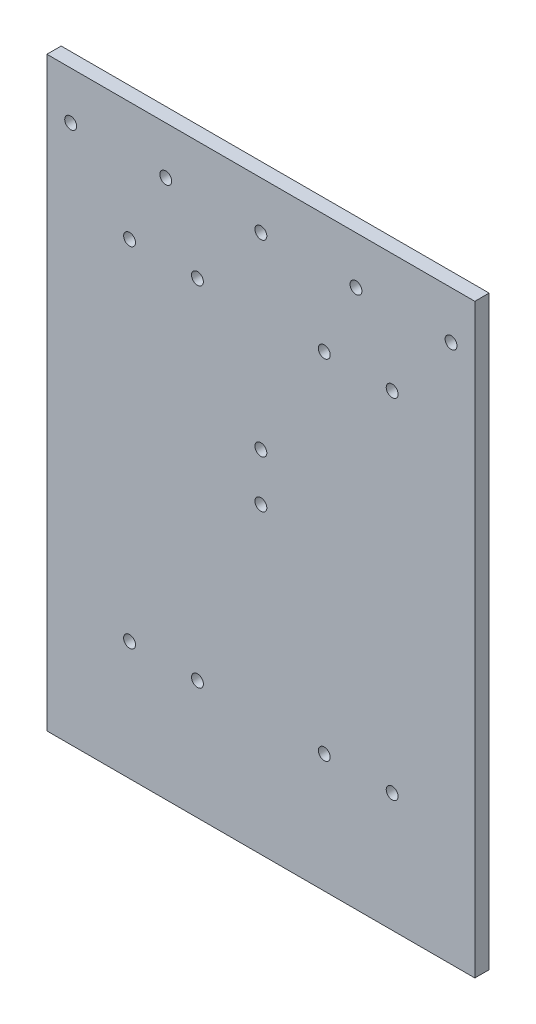
ISO-10303-21;
HEADER;
FILE_DESCRIPTION(('STEP AP214'),'2;1');
FILE_NAME('part.step','',(''),(''),'','','');
FILE_SCHEMA(('AUTOMOTIVE_DESIGN { 1 0 10303 214 1 1 1 1 }'));
ENDSEC;
DATA;
#1=APPLICATION_CONTEXT('core data for automotive mechanical design processes');
#2=APPLICATION_PROTOCOL_DEFINITION('international standard','automotive_design',2000,#1);
#3=PRODUCT_CONTEXT('',#1,'mechanical');
#4=PRODUCT('Part','Part','',(#3));
#5=PRODUCT_RELATED_PRODUCT_CATEGORY('part','',(#4));
#6=PRODUCT_DEFINITION_FORMATION('','',#4);
#7=PRODUCT_DEFINITION_CONTEXT('part definition',#1,'design');
#8=PRODUCT_DEFINITION('design','',#6,#7);
#9=PRODUCT_DEFINITION_SHAPE('','',#8);
#10=(LENGTH_UNIT() NAMED_UNIT(*) SI_UNIT(.MILLI.,.METRE.));
#11=(NAMED_UNIT(*) PLANE_ANGLE_UNIT() SI_UNIT($,.RADIAN.));
#12=(NAMED_UNIT(*) SI_UNIT($,.STERADIAN.) SOLID_ANGLE_UNIT());
#13=UNCERTAINTY_MEASURE_WITH_UNIT(LENGTH_MEASURE(1.E-05),#10,'distance_accuracy_value','');
#14=(GEOMETRIC_REPRESENTATION_CONTEXT(3) GLOBAL_UNCERTAINTY_ASSIGNED_CONTEXT((#13)) GLOBAL_UNIT_ASSIGNED_CONTEXT((#10,
#11,#12)) REPRESENTATION_CONTEXT('',''));
#15=CARTESIAN_POINT('',(0.,0.,0.));
#16=DIRECTION('',(0.,0.,1.));
#17=DIRECTION('',(1.,0.,0.));
#18=AXIS2_PLACEMENT_3D('',#15,#16,#17);
#19=CARTESIAN_POINT('',(0.,0.,6.));
#20=DIRECTION('',(0.,0.,1.));
#21=DIRECTION('',(1.,0.,0.));
#22=AXIS2_PLACEMENT_3D('',#19,#20,#21);
#23=PLANE('',#22);
#24=CARTESIAN_POINT('',(0.,-49.,6.));
#25=DIRECTION('',(0.,0.,1.));
#26=DIRECTION('',(1.,0.,0.));
#27=AXIS2_PLACEMENT_3D('',#24,#25,#26);
#28=CIRCLE('',#27,2.5);
#29=CARTESIAN_POINT('',(2.50000000000001,-49.,6.));
#30=VERTEX_POINT('',#29);
#31=EDGE_CURVE('E197',#30,#30,#28,.T.);
#32=ORIENTED_EDGE('',*,*,#31,.F.);
#33=EDGE_LOOP('',(#32));
#34=FACE_BOUND('',#33,.T.);
#35=CARTESIAN_POINT('',(40.,30.,6.));
#36=DIRECTION('',(0.,0.,1.));
#37=DIRECTION('',(1.,0.,0.));
#38=AXIS2_PLACEMENT_3D('',#35,#36,#37);
#39=CIRCLE('',#38,2.5);
#40=CARTESIAN_POINT('',(42.5,30.,6.));
#41=VERTEX_POINT('',#40);
#42=EDGE_CURVE('E185',#41,#41,#39,.T.);
#43=ORIENTED_EDGE('',*,*,#42,.F.);
#44=EDGE_LOOP('',(#43));
#45=FACE_BOUND('',#44,.T.);
#46=CARTESIAN_POINT('',(-40.,30.,6.));
#47=DIRECTION('',(0.,0.,1.));
#48=DIRECTION('',(1.,0.,0.));
#49=AXIS2_PLACEMENT_3D('',#46,#47,#48);
#50=CIRCLE('',#49,2.5);
#51=CARTESIAN_POINT('',(-37.5,30.,6.));
#52=VERTEX_POINT('',#51);
#53=EDGE_CURVE('E173',#52,#52,#50,.T.);
#54=ORIENTED_EDGE('',*,*,#53,.F.);
#55=EDGE_LOOP('',(#54));
#56=FACE_BOUND('',#55,.T.);
#57=CARTESIAN_POINT('',(55.225,-146.5,6.));
#58=DIRECTION('',(0.,0.,1.));
#59=DIRECTION('',(1.,0.,0.));
#60=AXIS2_PLACEMENT_3D('',#57,#58,#59);
#61=CIRCLE('',#60,2.5);
#62=CARTESIAN_POINT('',(57.725,-146.5,6.));
#63=VERTEX_POINT('',#62);
#64=EDGE_CURVE('E161',#63,#63,#61,.T.);
#65=ORIENTED_EDGE('',*,*,#64,.F.);
#66=EDGE_LOOP('',(#65));
#67=FACE_BOUND('',#66,.T.);
#68=CARTESIAN_POINT('',(-80.,30.,6.));
#69=DIRECTION('',(0.,0.,1.));
#70=DIRECTION('',(1.,0.,0.));
#71=AXIS2_PLACEMENT_3D('',#68,#69,#70);
#72=CIRCLE('',#71,2.50000000000001);
#73=CARTESIAN_POINT('',(-77.5,30.,6.));
#74=VERTEX_POINT('',#73);
#75=EDGE_CURVE('E149',#74,#74,#72,.T.);
#76=ORIENTED_EDGE('',*,*,#75,.F.);
#77=EDGE_LOOP('',(#76));
#78=FACE_BOUND('',#77,.T.);
#79=CARTESIAN_POINT('',(26.675,0.,6.));
#80=DIRECTION('',(0.,0.,1.));
#81=DIRECTION('',(1.,0.,0.));
#82=AXIS2_PLACEMENT_3D('',#79,#80,#81);
#83=CIRCLE('',#82,2.5);
#84=CARTESIAN_POINT('',(29.175,0.,6.));
#85=VERTEX_POINT('',#84);
#86=EDGE_CURVE('E137',#85,#85,#83,.T.);
#87=ORIENTED_EDGE('',*,*,#86,.F.);
#88=EDGE_LOOP('',(#87));
#89=FACE_BOUND('',#88,.T.);
#90=CARTESIAN_POINT('',(-26.675,0.,6.));
#91=DIRECTION('',(0.,0.,1.));
#92=DIRECTION('',(1.,0.,0.));
#93=AXIS2_PLACEMENT_3D('',#90,#91,#92);
#94=CIRCLE('',#93,2.5);
#95=CARTESIAN_POINT('',(-24.175,0.,6.));
#96=VERTEX_POINT('',#95);
#97=EDGE_CURVE('E125',#96,#96,#94,.T.);
#98=ORIENTED_EDGE('',*,*,#97,.F.);
#99=EDGE_LOOP('',(#98));
#100=FACE_BOUND('',#99,.T.);
#101=DIRECTION('',(0.,-1.,0.));
#102=VECTOR('',#101,1.);
#103=CARTESIAN_POINT('',(-90.,50.,6.));
#104=LINE('',#103,#102);
#105=CARTESIAN_POINT('',(-90.,50.,6.));
#106=VERTEX_POINT('',#105);
#107=CARTESIAN_POINT('',(-90.,-196.5,6.));
#108=VERTEX_POINT('',#107);
#109=EDGE_CURVE('E95',#106,#108,#104,.T.);
#110=ORIENTED_EDGE('',*,*,#109,.T.);
#111=DIRECTION('',(1.,0.,0.));
#112=VECTOR('',#111,1.);
#113=CARTESIAN_POINT('',(-90.,-196.5,6.));
#114=LINE('',#113,#112);
#115=CARTESIAN_POINT('',(90.,-196.5,6.));
#116=VERTEX_POINT('',#115);
#117=EDGE_CURVE('E90',#108,#116,#114,.T.);
#118=ORIENTED_EDGE('',*,*,#117,.T.);
#119=DIRECTION('',(0.,1.,0.));
#120=VECTOR('',#119,1.);
#121=CARTESIAN_POINT('',(90.,50.,6.));
#122=LINE('',#121,#120);
#123=CARTESIAN_POINT('',(90.,50.,6.));
#124=VERTEX_POINT('',#123);
#125=EDGE_CURVE('E93',#116,#124,#122,.T.);
#126=ORIENTED_EDGE('',*,*,#125,.T.);
#127=DIRECTION('',(-1.,0.,0.));
#128=VECTOR('',#127,1.);
#129=CARTESIAN_POINT('',(-90.,50.,6.));
#130=LINE('',#129,#128);
#131=EDGE_CURVE('E60',#124,#106,#130,.T.);
#132=ORIENTED_EDGE('',*,*,#131,.T.);
#133=EDGE_LOOP('',(#110,#118,#126,#132));
#134=FACE_BOUND('',#133,.T.);
#135=CARTESIAN_POINT('',(-55.225,0.,6.));
#136=DIRECTION('',(0.,0.,1.));
#137=DIRECTION('',(1.,0.,0.));
#138=AXIS2_PLACEMENT_3D('',#135,#136,#137);
#139=CIRCLE('',#138,2.5);
#140=CARTESIAN_POINT('',(-52.725,0.,6.));
#141=VERTEX_POINT('',#140);
#142=EDGE_CURVE('E110',#141,#141,#139,.T.);
#143=ORIENTED_EDGE('',*,*,#142,.F.);
#144=EDGE_LOOP('',(#143));
#145=FACE_BOUND('',#144,.T.);
#146=CARTESIAN_POINT('',(55.225,0.,6.));
#147=DIRECTION('',(0.,0.,1.));
#148=DIRECTION('',(1.,0.,0.));
#149=AXIS2_PLACEMENT_3D('',#146,#147,#148);
#150=CIRCLE('',#149,2.5);
#151=CARTESIAN_POINT('',(57.725,0.,6.));
#152=VERTEX_POINT('',#151);
#153=EDGE_CURVE('E131',#152,#152,#150,.T.);
#154=ORIENTED_EDGE('',*,*,#153,.F.);
#155=EDGE_LOOP('',(#154));
#156=FACE_BOUND('',#155,.T.);
#157=CARTESIAN_POINT('',(-55.225,-146.5,6.));
#158=DIRECTION('',(0.,0.,1.));
#159=DIRECTION('',(1.,0.,0.));
#160=AXIS2_PLACEMENT_3D('',#157,#158,#159);
#161=CIRCLE('',#160,2.5);
#162=CARTESIAN_POINT('',(-52.725,-146.5,6.));
#163=VERTEX_POINT('',#162);
#164=EDGE_CURVE('E143',#163,#163,#161,.T.);
#165=ORIENTED_EDGE('',*,*,#164,.F.);
#166=EDGE_LOOP('',(#165));
#167=FACE_BOUND('',#166,.T.);
#168=CARTESIAN_POINT('',(-26.675,-146.5,6.));
#169=DIRECTION('',(0.,0.,1.));
#170=DIRECTION('',(1.,0.,0.));
#171=AXIS2_PLACEMENT_3D('',#168,#169,#170);
#172=CIRCLE('',#171,2.50000000000001);
#173=CARTESIAN_POINT('',(-24.175,-146.5,6.));
#174=VERTEX_POINT('',#173);
#175=EDGE_CURVE('E155',#174,#174,#172,.T.);
#176=ORIENTED_EDGE('',*,*,#175,.F.);
#177=EDGE_LOOP('',(#176));
#178=FACE_BOUND('',#177,.T.);
#179=CARTESIAN_POINT('',(26.675,-146.5,6.));
#180=DIRECTION('',(0.,0.,1.));
#181=DIRECTION('',(1.,0.,0.));
#182=AXIS2_PLACEMENT_3D('',#179,#180,#181);
#183=CIRCLE('',#182,2.5);
#184=CARTESIAN_POINT('',(29.175,-146.5,6.));
#185=VERTEX_POINT('',#184);
#186=EDGE_CURVE('E167',#185,#185,#183,.T.);
#187=ORIENTED_EDGE('',*,*,#186,.F.);
#188=EDGE_LOOP('',(#187));
#189=FACE_BOUND('',#188,.T.);
#190=CARTESIAN_POINT('',(80.,30.,6.));
#191=DIRECTION('',(0.,0.,1.));
#192=DIRECTION('',(1.,0.,0.));
#193=AXIS2_PLACEMENT_3D('',#190,#191,#192);
#194=CIRCLE('',#193,2.50000000000001);
#195=CARTESIAN_POINT('',(82.5,30.,6.));
#196=VERTEX_POINT('',#195);
#197=EDGE_CURVE('E179',#196,#196,#194,.T.);
#198=ORIENTED_EDGE('',*,*,#197,.F.);
#199=EDGE_LOOP('',(#198));
#200=FACE_BOUND('',#199,.T.);
#201=CARTESIAN_POINT('',(0.,30.,6.));
#202=DIRECTION('',(0.,0.,1.));
#203=DIRECTION('',(1.,0.,0.));
#204=AXIS2_PLACEMENT_3D('',#201,#202,#203);
#205=CIRCLE('',#204,2.5);
#206=CARTESIAN_POINT('',(2.5,30.,6.));
#207=VERTEX_POINT('',#206);
#208=EDGE_CURVE('E191',#207,#207,#205,.T.);
#209=ORIENTED_EDGE('',*,*,#208,.F.);
#210=EDGE_LOOP('',(#209));
#211=FACE_BOUND('',#210,.T.);
#212=CARTESIAN_POINT('',(0.,-69.,6.));
#213=DIRECTION('',(0.,0.,1.));
#214=DIRECTION('',(1.,0.,0.));
#215=AXIS2_PLACEMENT_3D('',#212,#213,#214);
#216=CIRCLE('',#215,2.5);
#217=CARTESIAN_POINT('',(2.50000000000001,-69.,6.));
#218=VERTEX_POINT('',#217);
#219=EDGE_CURVE('E203',#218,#218,#216,.T.);
#220=ORIENTED_EDGE('',*,*,#219,.F.);
#221=EDGE_LOOP('',(#220));
#222=FACE_BOUND('',#221,.T.);
#223=ADVANCED_FACE('F43',(#34,#45,#56,#67,#78,#89,#100,#134,#145,#156,#167,#178,#189,#200,#211,
#222),#23,.T.);
#224=CARTESIAN_POINT('',(0.,0.,0.));
#225=DIRECTION('',(0.,0.,1.));
#226=DIRECTION('',(1.,0.,0.));
#227=AXIS2_PLACEMENT_3D('',#224,#225,#226);
#228=PLANE('',#227);
#229=DIRECTION('',(0.,-1.,0.));
#230=VECTOR('',#229,1.);
#231=CARTESIAN_POINT('',(-90.,50.,0.));
#232=LINE('',#231,#230);
#233=CARTESIAN_POINT('',(-90.,50.,0.));
#234=VERTEX_POINT('',#233);
#235=CARTESIAN_POINT('',(-90.,-196.5,0.));
#236=VERTEX_POINT('',#235);
#237=EDGE_CURVE('E107',#234,#236,#232,.T.);
#238=ORIENTED_EDGE('',*,*,#237,.F.);
#239=DIRECTION('',(-1.,0.,0.));
#240=VECTOR('',#239,1.);
#241=CARTESIAN_POINT('',(-90.,50.,0.));
#242=LINE('',#241,#240);
#243=CARTESIAN_POINT('',(90.,50.,0.));
#244=VERTEX_POINT('',#243);
#245=EDGE_CURVE('E83',#244,#234,#242,.T.);
#246=ORIENTED_EDGE('',*,*,#245,.F.);
#247=DIRECTION('',(0.,1.,0.));
#248=VECTOR('',#247,1.);
#249=CARTESIAN_POINT('',(90.,50.,0.));
#250=LINE('',#249,#248);
#251=CARTESIAN_POINT('',(90.,-196.5,0.));
#252=VERTEX_POINT('',#251);
#253=EDGE_CURVE('E77',#252,#244,#250,.T.);
#254=ORIENTED_EDGE('',*,*,#253,.F.);
#255=DIRECTION('',(1.,0.,0.));
#256=VECTOR('',#255,1.);
#257=CARTESIAN_POINT('',(-90.,-196.5,0.));
#258=LINE('',#257,#256);
#259=EDGE_CURVE('E99',#236,#252,#258,.T.);
#260=ORIENTED_EDGE('',*,*,#259,.F.);
#261=EDGE_LOOP('',(#238,#246,#254,#260));
#262=FACE_BOUND('',#261,.T.);
#263=CARTESIAN_POINT('',(-55.225,0.,0.));
#264=DIRECTION('',(0.,0.,1.));
#265=DIRECTION('',(1.,0.,0.));
#266=AXIS2_PLACEMENT_3D('',#263,#264,#265);
#267=CIRCLE('',#266,2.5);
#268=CARTESIAN_POINT('',(-52.725,0.,0.));
#269=VERTEX_POINT('',#268);
#270=EDGE_CURVE('E122',#269,#269,#267,.T.);
#271=ORIENTED_EDGE('',*,*,#270,.T.);
#272=EDGE_LOOP('',(#271));
#273=FACE_BOUND('',#272,.T.);
#274=CARTESIAN_POINT('',(-26.675,0.,0.));
#275=DIRECTION('',(0.,0.,1.));
#276=DIRECTION('',(1.,0.,0.));
#277=AXIS2_PLACEMENT_3D('',#274,#275,#276);
#278=CIRCLE('',#277,2.5);
#279=CARTESIAN_POINT('',(-24.175,0.,0.));
#280=VERTEX_POINT('',#279);
#281=EDGE_CURVE('E128',#280,#280,#278,.T.);
#282=ORIENTED_EDGE('',*,*,#281,.T.);
#283=EDGE_LOOP('',(#282));
#284=FACE_BOUND('',#283,.T.);
#285=CARTESIAN_POINT('',(55.225,0.,0.));
#286=DIRECTION('',(0.,0.,1.));
#287=DIRECTION('',(1.,0.,0.));
#288=AXIS2_PLACEMENT_3D('',#285,#286,#287);
#289=CIRCLE('',#288,2.5);
#290=CARTESIAN_POINT('',(57.725,0.,0.));
#291=VERTEX_POINT('',#290);
#292=EDGE_CURVE('E134',#291,#291,#289,.T.);
#293=ORIENTED_EDGE('',*,*,#292,.T.);
#294=EDGE_LOOP('',(#293));
#295=FACE_BOUND('',#294,.T.);
#296=CARTESIAN_POINT('',(26.675,0.,0.));
#297=DIRECTION('',(0.,0.,1.));
#298=DIRECTION('',(1.,0.,0.));
#299=AXIS2_PLACEMENT_3D('',#296,#297,#298);
#300=CIRCLE('',#299,2.5);
#301=CARTESIAN_POINT('',(29.175,0.,0.));
#302=VERTEX_POINT('',#301);
#303=EDGE_CURVE('E140',#302,#302,#300,.T.);
#304=ORIENTED_EDGE('',*,*,#303,.T.);
#305=EDGE_LOOP('',(#304));
#306=FACE_BOUND('',#305,.T.);
#307=CARTESIAN_POINT('',(-55.225,-146.5,0.));
#308=DIRECTION('',(0.,0.,1.));
#309=DIRECTION('',(1.,0.,0.));
#310=AXIS2_PLACEMENT_3D('',#307,#308,#309);
#311=CIRCLE('',#310,2.5);
#312=CARTESIAN_POINT('',(-52.725,-146.5,0.));
#313=VERTEX_POINT('',#312);
#314=EDGE_CURVE('E146',#313,#313,#311,.T.);
#315=ORIENTED_EDGE('',*,*,#314,.T.);
#316=EDGE_LOOP('',(#315));
#317=FACE_BOUND('',#316,.T.);
#318=CARTESIAN_POINT('',(-80.,30.,0.));
#319=DIRECTION('',(0.,0.,1.));
#320=DIRECTION('',(1.,0.,0.));
#321=AXIS2_PLACEMENT_3D('',#318,#319,#320);
#322=CIRCLE('',#321,2.50000000000001);
#323=CARTESIAN_POINT('',(-77.5,30.,0.));
#324=VERTEX_POINT('',#323);
#325=EDGE_CURVE('E152',#324,#324,#322,.T.);
#326=ORIENTED_EDGE('',*,*,#325,.T.);
#327=EDGE_LOOP('',(#326));
#328=FACE_BOUND('',#327,.T.);
#329=CARTESIAN_POINT('',(-26.675,-146.5,0.));
#330=DIRECTION('',(0.,0.,1.));
#331=DIRECTION('',(1.,0.,0.));
#332=AXIS2_PLACEMENT_3D('',#329,#330,#331);
#333=CIRCLE('',#332,2.50000000000001);
#334=CARTESIAN_POINT('',(-24.175,-146.5,0.));
#335=VERTEX_POINT('',#334);
#336=EDGE_CURVE('E158',#335,#335,#333,.T.);
#337=ORIENTED_EDGE('',*,*,#336,.T.);
#338=EDGE_LOOP('',(#337));
#339=FACE_BOUND('',#338,.T.);
#340=CARTESIAN_POINT('',(55.225,-146.5,0.));
#341=DIRECTION('',(0.,0.,1.));
#342=DIRECTION('',(1.,0.,0.));
#343=AXIS2_PLACEMENT_3D('',#340,#341,#342);
#344=CIRCLE('',#343,2.5);
#345=CARTESIAN_POINT('',(57.725,-146.5,0.));
#346=VERTEX_POINT('',#345);
#347=EDGE_CURVE('E164',#346,#346,#344,.T.);
#348=ORIENTED_EDGE('',*,*,#347,.T.);
#349=EDGE_LOOP('',(#348));
#350=FACE_BOUND('',#349,.T.);
#351=CARTESIAN_POINT('',(26.675,-146.5,0.));
#352=DIRECTION('',(0.,0.,1.));
#353=DIRECTION('',(1.,0.,0.));
#354=AXIS2_PLACEMENT_3D('',#351,#352,#353);
#355=CIRCLE('',#354,2.5);
#356=CARTESIAN_POINT('',(29.175,-146.5,0.));
#357=VERTEX_POINT('',#356);
#358=EDGE_CURVE('E170',#357,#357,#355,.T.);
#359=ORIENTED_EDGE('',*,*,#358,.T.);
#360=EDGE_LOOP('',(#359));
#361=FACE_BOUND('',#360,.T.);
#362=CARTESIAN_POINT('',(-40.,30.,0.));
#363=DIRECTION('',(0.,0.,1.));
#364=DIRECTION('',(1.,0.,0.));
#365=AXIS2_PLACEMENT_3D('',#362,#363,#364);
#366=CIRCLE('',#365,2.5);
#367=CARTESIAN_POINT('',(-37.5,30.,0.));
#368=VERTEX_POINT('',#367);
#369=EDGE_CURVE('E176',#368,#368,#366,.T.);
#370=ORIENTED_EDGE('',*,*,#369,.T.);
#371=EDGE_LOOP('',(#370));
#372=FACE_BOUND('',#371,.T.);
#373=CARTESIAN_POINT('',(80.,30.,0.));
#374=DIRECTION('',(0.,0.,1.));
#375=DIRECTION('',(1.,0.,0.));
#376=AXIS2_PLACEMENT_3D('',#373,#374,#375);
#377=CIRCLE('',#376,2.50000000000001);
#378=CARTESIAN_POINT('',(82.5,30.,0.));
#379=VERTEX_POINT('',#378);
#380=EDGE_CURVE('E182',#379,#379,#377,.T.);
#381=ORIENTED_EDGE('',*,*,#380,.T.);
#382=EDGE_LOOP('',(#381));
#383=FACE_BOUND('',#382,.T.);
#384=CARTESIAN_POINT('',(40.,30.,0.));
#385=DIRECTION('',(0.,0.,1.));
#386=DIRECTION('',(1.,0.,0.));
#387=AXIS2_PLACEMENT_3D('',#384,#385,#386);
#388=CIRCLE('',#387,2.5);
#389=CARTESIAN_POINT('',(42.5,30.,0.));
#390=VERTEX_POINT('',#389);
#391=EDGE_CURVE('E188',#390,#390,#388,.T.);
#392=ORIENTED_EDGE('',*,*,#391,.T.);
#393=EDGE_LOOP('',(#392));
#394=FACE_BOUND('',#393,.T.);
#395=CARTESIAN_POINT('',(0.,30.,0.));
#396=DIRECTION('',(0.,0.,1.));
#397=DIRECTION('',(1.,0.,0.));
#398=AXIS2_PLACEMENT_3D('',#395,#396,#397);
#399=CIRCLE('',#398,2.5);
#400=CARTESIAN_POINT('',(2.5,30.,0.));
#401=VERTEX_POINT('',#400);
#402=EDGE_CURVE('E194',#401,#401,#399,.T.);
#403=ORIENTED_EDGE('',*,*,#402,.T.);
#404=EDGE_LOOP('',(#403));
#405=FACE_BOUND('',#404,.T.);
#406=CARTESIAN_POINT('',(0.,-49.,0.));
#407=DIRECTION('',(0.,0.,1.));
#408=DIRECTION('',(1.,0.,0.));
#409=AXIS2_PLACEMENT_3D('',#406,#407,#408);
#410=CIRCLE('',#409,2.5);
#411=CARTESIAN_POINT('',(2.50000000000001,-49.,0.));
#412=VERTEX_POINT('',#411);
#413=EDGE_CURVE('E200',#412,#412,#410,.T.);
#414=ORIENTED_EDGE('',*,*,#413,.T.);
#415=EDGE_LOOP('',(#414));
#416=FACE_BOUND('',#415,.T.);
#417=CARTESIAN_POINT('',(0.,-69.,0.));
#418=DIRECTION('',(0.,0.,1.));
#419=DIRECTION('',(1.,0.,0.));
#420=AXIS2_PLACEMENT_3D('',#417,#418,#419);
#421=CIRCLE('',#420,2.5);
#422=CARTESIAN_POINT('',(2.50000000000001,-69.,0.));
#423=VERTEX_POINT('',#422);
#424=EDGE_CURVE('E206',#423,#423,#421,.T.);
#425=ORIENTED_EDGE('',*,*,#424,.T.);
#426=EDGE_LOOP('',(#425));
#427=FACE_BOUND('',#426,.T.);
#428=ADVANCED_FACE('F118',(#262,#273,#284,#295,#306,#317,#328,#339,#350,#361,#372,#383,#394,
#405,#416,#427),#228,.F.);
#429=CARTESIAN_POINT('',(-90.,50.,6.));
#430=DIRECTION('',(1.,0.,0.));
#431=DIRECTION('',(0.,1.,0.));
#432=AXIS2_PLACEMENT_3D('',#429,#430,#431);
#433=PLANE('',#432);
#434=ORIENTED_EDGE('',*,*,#237,.T.);
#435=DIRECTION('',(0.,0.,-1.));
#436=VECTOR('',#435,1.);
#437=CARTESIAN_POINT('',(-90.,-196.5,6.));
#438=LINE('',#437,#436);
#439=EDGE_CURVE('E11',#108,#236,#438,.T.);
#440=ORIENTED_EDGE('',*,*,#439,.F.);
#441=ORIENTED_EDGE('',*,*,#109,.F.);
#442=DIRECTION('',(0.,0.,-1.));
#443=VECTOR('',#442,1.);
#444=CARTESIAN_POINT('',(-90.,50.,6.));
#445=LINE('',#444,#443);
#446=EDGE_CURVE('E103',#106,#234,#445,.T.);
#447=ORIENTED_EDGE('',*,*,#446,.T.);
#448=EDGE_LOOP('',(#434,#440,#441,#447));
#449=FACE_BOUND('',#448,.T.);
#450=ADVANCED_FACE('F45',(#449),#433,.F.);
#451=CARTESIAN_POINT('',(-90.,-196.5,6.));
#452=DIRECTION('',(0.,1.,0.));
#453=DIRECTION('',(-1.,0.,0.));
#454=AXIS2_PLACEMENT_3D('',#451,#452,#453);
#455=PLANE('',#454);
#456=ORIENTED_EDGE('',*,*,#259,.T.);
#457=DIRECTION('',(0.,0.,-1.));
#458=VECTOR('',#457,1.);
#459=CARTESIAN_POINT('',(90.,-196.5,6.));
#460=LINE('',#459,#458);
#461=EDGE_CURVE('E52',#116,#252,#460,.T.);
#462=ORIENTED_EDGE('',*,*,#461,.F.);
#463=ORIENTED_EDGE('',*,*,#117,.F.);
#464=ORIENTED_EDGE('',*,*,#439,.T.);
#465=EDGE_LOOP('',(#456,#462,#463,#464));
#466=FACE_BOUND('',#465,.T.);
#467=ADVANCED_FACE('F98',(#466),#455,.F.);
#468=CARTESIAN_POINT('',(90.,50.,6.));
#469=DIRECTION('',(-1.,0.,0.));
#470=DIRECTION('',(0.,-1.,0.));
#471=AXIS2_PLACEMENT_3D('',#468,#469,#470);
#472=PLANE('',#471);
#473=ORIENTED_EDGE('',*,*,#253,.T.);
#474=DIRECTION('',(0.,0.,-1.));
#475=VECTOR('',#474,1.);
#476=CARTESIAN_POINT('',(90.,50.,6.));
#477=LINE('',#476,#475);
#478=EDGE_CURVE('E100',#124,#244,#477,.T.);
#479=ORIENTED_EDGE('',*,*,#478,.F.);
#480=ORIENTED_EDGE('',*,*,#125,.F.);
#481=ORIENTED_EDGE('',*,*,#461,.T.);
#482=EDGE_LOOP('',(#473,#479,#480,#481));
#483=FACE_BOUND('',#482,.T.);
#484=ADVANCED_FACE('F101',(#483),#472,.F.);
#485=CARTESIAN_POINT('',(-90.,50.,6.));
#486=DIRECTION('',(0.,-1.,0.));
#487=DIRECTION('',(1.,0.,0.));
#488=AXIS2_PLACEMENT_3D('',#485,#486,#487);
#489=PLANE('',#488);
#490=ORIENTED_EDGE('',*,*,#245,.T.);
#491=ORIENTED_EDGE('',*,*,#446,.F.);
#492=ORIENTED_EDGE('',*,*,#131,.F.);
#493=ORIENTED_EDGE('',*,*,#478,.T.);
#494=EDGE_LOOP('',(#490,#491,#492,#493));
#495=FACE_BOUND('',#494,.T.);
#496=ADVANCED_FACE('F115',(#495),#489,.F.);
#497=CARTESIAN_POINT('',(-55.225,0.,6.));
#498=DIRECTION('',(0.,0.,-1.));
#499=DIRECTION('',(-1.,0.,0.));
#500=AXIS2_PLACEMENT_3D('',#497,#498,#499);
#501=CYLINDRICAL_SURFACE('',#500,2.5);
#502=ORIENTED_EDGE('',*,*,#142,.T.);
#503=EDGE_LOOP('',(#502));
#504=FACE_BOUND('',#503,.T.);
#505=ORIENTED_EDGE('',*,*,#270,.F.);
#506=EDGE_LOOP('',(#505));
#507=FACE_BOUND('',#506,.T.);
#508=ADVANCED_FACE('F225',(#504,#507),#501,.F.);
#509=CARTESIAN_POINT('',(-26.675,0.,6.));
#510=DIRECTION('',(0.,0.,-1.));
#511=DIRECTION('',(-1.,0.,0.));
#512=AXIS2_PLACEMENT_3D('',#509,#510,#511);
#513=CYLINDRICAL_SURFACE('',#512,2.5);
#514=ORIENTED_EDGE('',*,*,#97,.T.);
#515=EDGE_LOOP('',(#514));
#516=FACE_BOUND('',#515,.T.);
#517=ORIENTED_EDGE('',*,*,#281,.F.);
#518=EDGE_LOOP('',(#517));
#519=FACE_BOUND('',#518,.T.);
#520=ADVANCED_FACE('F279',(#516,#519),#513,.F.);
#521=CARTESIAN_POINT('',(55.225,0.,6.));
#522=DIRECTION('',(0.,0.,-1.));
#523=DIRECTION('',(-1.,0.,0.));
#524=AXIS2_PLACEMENT_3D('',#521,#522,#523);
#525=CYLINDRICAL_SURFACE('',#524,2.5);
#526=ORIENTED_EDGE('',*,*,#153,.T.);
#527=EDGE_LOOP('',(#526));
#528=FACE_BOUND('',#527,.T.);
#529=ORIENTED_EDGE('',*,*,#292,.F.);
#530=EDGE_LOOP('',(#529));
#531=FACE_BOUND('',#530,.T.);
#532=ADVANCED_FACE('F288',(#528,#531),#525,.F.);
#533=CARTESIAN_POINT('',(26.675,0.,6.));
#534=DIRECTION('',(0.,0.,-1.));
#535=DIRECTION('',(-1.,0.,0.));
#536=AXIS2_PLACEMENT_3D('',#533,#534,#535);
#537=CYLINDRICAL_SURFACE('',#536,2.5);
#538=ORIENTED_EDGE('',*,*,#86,.T.);
#539=EDGE_LOOP('',(#538));
#540=FACE_BOUND('',#539,.T.);
#541=ORIENTED_EDGE('',*,*,#303,.F.);
#542=EDGE_LOOP('',(#541));
#543=FACE_BOUND('',#542,.T.);
#544=ADVANCED_FACE('F297',(#540,#543),#537,.F.);
#545=CARTESIAN_POINT('',(-55.225,-146.5,6.));
#546=DIRECTION('',(0.,0.,-1.));
#547=DIRECTION('',(-1.,0.,0.));
#548=AXIS2_PLACEMENT_3D('',#545,#546,#547);
#549=CYLINDRICAL_SURFACE('',#548,2.5);
#550=ORIENTED_EDGE('',*,*,#164,.T.);
#551=EDGE_LOOP('',(#550));
#552=FACE_BOUND('',#551,.T.);
#553=ORIENTED_EDGE('',*,*,#314,.F.);
#554=EDGE_LOOP('',(#553));
#555=FACE_BOUND('',#554,.T.);
#556=ADVANCED_FACE('F307',(#552,#555),#549,.F.);
#557=CARTESIAN_POINT('',(-80.,30.,6.));
#558=DIRECTION('',(0.,0.,-1.));
#559=DIRECTION('',(-1.,0.,0.));
#560=AXIS2_PLACEMENT_3D('',#557,#558,#559);
#561=CYLINDRICAL_SURFACE('',#560,2.50000000000001);
#562=ORIENTED_EDGE('',*,*,#75,.T.);
#563=EDGE_LOOP('',(#562));
#564=FACE_BOUND('',#563,.T.);
#565=ORIENTED_EDGE('',*,*,#325,.F.);
#566=EDGE_LOOP('',(#565));
#567=FACE_BOUND('',#566,.T.);
#568=ADVANCED_FACE('F317',(#564,#567),#561,.F.);
#569=CARTESIAN_POINT('',(-26.675,-146.5,6.));
#570=DIRECTION('',(0.,0.,-1.));
#571=DIRECTION('',(-1.,0.,0.));
#572=AXIS2_PLACEMENT_3D('',#569,#570,#571);
#573=CYLINDRICAL_SURFACE('',#572,2.50000000000001);
#574=ORIENTED_EDGE('',*,*,#175,.T.);
#575=EDGE_LOOP('',(#574));
#576=FACE_BOUND('',#575,.T.);
#577=ORIENTED_EDGE('',*,*,#336,.F.);
#578=EDGE_LOOP('',(#577));
#579=FACE_BOUND('',#578,.T.);
#580=ADVANCED_FACE('F327',(#576,#579),#573,.F.);
#581=CARTESIAN_POINT('',(55.225,-146.5,6.));
#582=DIRECTION('',(0.,0.,-1.));
#583=DIRECTION('',(-1.,0.,0.));
#584=AXIS2_PLACEMENT_3D('',#581,#582,#583);
#585=CYLINDRICAL_SURFACE('',#584,2.5);
#586=ORIENTED_EDGE('',*,*,#64,.T.);
#587=EDGE_LOOP('',(#586));
#588=FACE_BOUND('',#587,.T.);
#589=ORIENTED_EDGE('',*,*,#347,.F.);
#590=EDGE_LOOP('',(#589));
#591=FACE_BOUND('',#590,.T.);
#592=ADVANCED_FACE('F337',(#588,#591),#585,.F.);
#593=CARTESIAN_POINT('',(26.675,-146.5,6.));
#594=DIRECTION('',(0.,0.,-1.));
#595=DIRECTION('',(-1.,0.,0.));
#596=AXIS2_PLACEMENT_3D('',#593,#594,#595);
#597=CYLINDRICAL_SURFACE('',#596,2.5);
#598=ORIENTED_EDGE('',*,*,#186,.T.);
#599=EDGE_LOOP('',(#598));
#600=FACE_BOUND('',#599,.T.);
#601=ORIENTED_EDGE('',*,*,#358,.F.);
#602=EDGE_LOOP('',(#601));
#603=FACE_BOUND('',#602,.T.);
#604=ADVANCED_FACE('F347',(#600,#603),#597,.F.);
#605=CARTESIAN_POINT('',(-40.,30.,6.));
#606=DIRECTION('',(0.,0.,-1.));
#607=DIRECTION('',(-1.,0.,0.));
#608=AXIS2_PLACEMENT_3D('',#605,#606,#607);
#609=CYLINDRICAL_SURFACE('',#608,2.5);
#610=ORIENTED_EDGE('',*,*,#53,.T.);
#611=EDGE_LOOP('',(#610));
#612=FACE_BOUND('',#611,.T.);
#613=ORIENTED_EDGE('',*,*,#369,.F.);
#614=EDGE_LOOP('',(#613));
#615=FACE_BOUND('',#614,.T.);
#616=ADVANCED_FACE('F357',(#612,#615),#609,.F.);
#617=CARTESIAN_POINT('',(80.,30.,6.));
#618=DIRECTION('',(0.,0.,-1.));
#619=DIRECTION('',(-1.,0.,0.));
#620=AXIS2_PLACEMENT_3D('',#617,#618,#619);
#621=CYLINDRICAL_SURFACE('',#620,2.50000000000001);
#622=ORIENTED_EDGE('',*,*,#197,.T.);
#623=EDGE_LOOP('',(#622));
#624=FACE_BOUND('',#623,.T.);
#625=ORIENTED_EDGE('',*,*,#380,.F.);
#626=EDGE_LOOP('',(#625));
#627=FACE_BOUND('',#626,.T.);
#628=ADVANCED_FACE('F367',(#624,#627),#621,.F.);
#629=CARTESIAN_POINT('',(40.,30.,6.));
#630=DIRECTION('',(0.,0.,-1.));
#631=DIRECTION('',(-1.,0.,0.));
#632=AXIS2_PLACEMENT_3D('',#629,#630,#631);
#633=CYLINDRICAL_SURFACE('',#632,2.5);
#634=ORIENTED_EDGE('',*,*,#42,.T.);
#635=EDGE_LOOP('',(#634));
#636=FACE_BOUND('',#635,.T.);
#637=ORIENTED_EDGE('',*,*,#391,.F.);
#638=EDGE_LOOP('',(#637));
#639=FACE_BOUND('',#638,.T.);
#640=ADVANCED_FACE('F377',(#636,#639),#633,.F.);
#641=CARTESIAN_POINT('',(0.,30.,6.));
#642=DIRECTION('',(0.,0.,-1.));
#643=DIRECTION('',(-1.,0.,0.));
#644=AXIS2_PLACEMENT_3D('',#641,#642,#643);
#645=CYLINDRICAL_SURFACE('',#644,2.5);
#646=ORIENTED_EDGE('',*,*,#208,.T.);
#647=EDGE_LOOP('',(#646));
#648=FACE_BOUND('',#647,.T.);
#649=ORIENTED_EDGE('',*,*,#402,.F.);
#650=EDGE_LOOP('',(#649));
#651=FACE_BOUND('',#650,.T.);
#652=ADVANCED_FACE('F387',(#648,#651),#645,.F.);
#653=CARTESIAN_POINT('',(0.,-49.,6.));
#654=DIRECTION('',(0.,0.,-1.));
#655=DIRECTION('',(-1.,0.,0.));
#656=AXIS2_PLACEMENT_3D('',#653,#654,#655);
#657=CYLINDRICAL_SURFACE('',#656,2.5);
#658=ORIENTED_EDGE('',*,*,#31,.T.);
#659=EDGE_LOOP('',(#658));
#660=FACE_BOUND('',#659,.T.);
#661=ORIENTED_EDGE('',*,*,#413,.F.);
#662=EDGE_LOOP('',(#661));
#663=FACE_BOUND('',#662,.T.);
#664=ADVANCED_FACE('F397',(#660,#663),#657,.F.);
#665=CARTESIAN_POINT('',(0.,-69.,6.));
#666=DIRECTION('',(0.,0.,-1.));
#667=DIRECTION('',(-1.,0.,0.));
#668=AXIS2_PLACEMENT_3D('',#665,#666,#667);
#669=CYLINDRICAL_SURFACE('',#668,2.5);
#670=ORIENTED_EDGE('',*,*,#219,.T.);
#671=EDGE_LOOP('',(#670));
#672=FACE_BOUND('',#671,.T.);
#673=ORIENTED_EDGE('',*,*,#424,.F.);
#674=EDGE_LOOP('',(#673));
#675=FACE_BOUND('',#674,.T.);
#676=ADVANCED_FACE('F212',(#672,#675),#669,.F.);
#677=CLOSED_SHELL('',(#223,#428,#450,#467,#484,#496,#508,#520,#532,#544,#556,#568,#580,#592,
#604,#616,#628,#640,#652,#664,#676));
#678=MANIFOLD_SOLID_BREP('B2',#677);
#679=ADVANCED_BREP_SHAPE_REPRESENTATION('',(#18,#678),#14);
#680=SHAPE_DEFINITION_REPRESENTATION(#9,#679);
ENDSEC;
END-ISO-10303-21;
